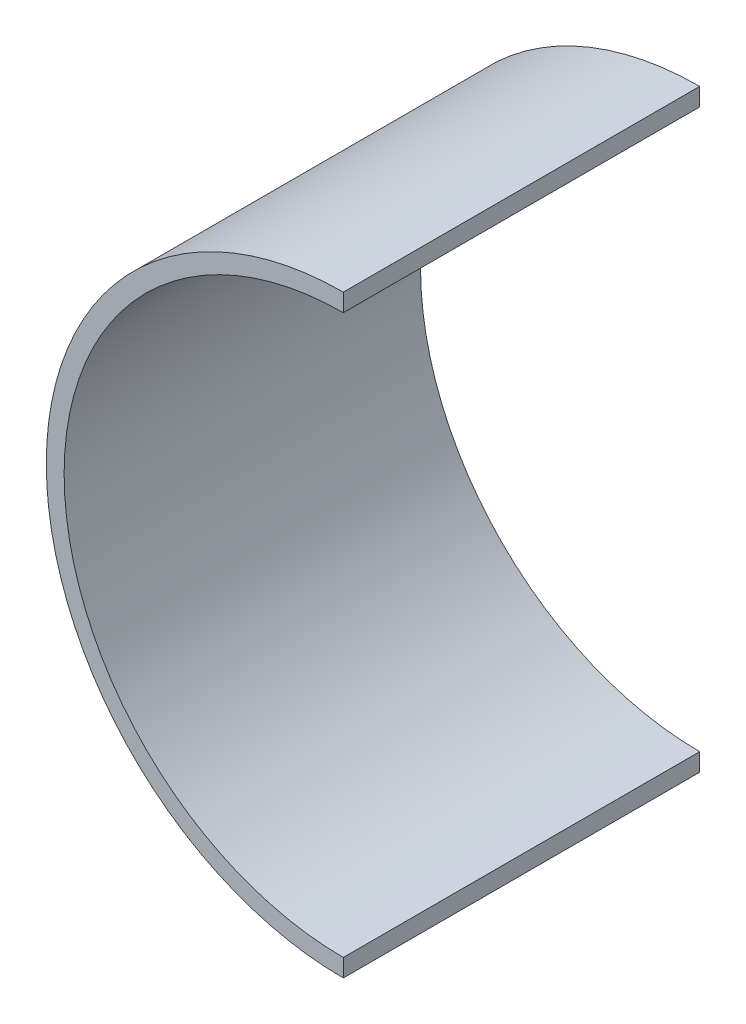
ISO-10303-21;
HEADER;
FILE_DESCRIPTION(('STEP AP214'),'2;1');
FILE_NAME('part.step','',(''),(''),'','','');
FILE_SCHEMA(('AUTOMOTIVE_DESIGN { 1 0 10303 214 1 1 1 1 }'));
ENDSEC;
DATA;
#1=APPLICATION_CONTEXT('core data for automotive mechanical design processes');
#2=APPLICATION_PROTOCOL_DEFINITION('international standard','automotive_design',2000,#1);
#3=PRODUCT_CONTEXT('',#1,'mechanical');
#4=PRODUCT('Part','Part','',(#3));
#5=PRODUCT_RELATED_PRODUCT_CATEGORY('part','',(#4));
#6=PRODUCT_DEFINITION_FORMATION('','',#4);
#7=PRODUCT_DEFINITION_CONTEXT('part definition',#1,'design');
#8=PRODUCT_DEFINITION('design','',#6,#7);
#9=PRODUCT_DEFINITION_SHAPE('','',#8);
#10=(LENGTH_UNIT() NAMED_UNIT(*) SI_UNIT(.MILLI.,.METRE.));
#11=(NAMED_UNIT(*) PLANE_ANGLE_UNIT() SI_UNIT($,.RADIAN.));
#12=(NAMED_UNIT(*) SI_UNIT($,.STERADIAN.) SOLID_ANGLE_UNIT());
#13=UNCERTAINTY_MEASURE_WITH_UNIT(LENGTH_MEASURE(1.E-05),#10,'distance_accuracy_value','');
#14=(GEOMETRIC_REPRESENTATION_CONTEXT(3) GLOBAL_UNCERTAINTY_ASSIGNED_CONTEXT((#13)) GLOBAL_UNIT_ASSIGNED_CONTEXT((#10,
#11,#12)) REPRESENTATION_CONTEXT('',''));
#15=CARTESIAN_POINT('',(0.,0.,0.));
#16=DIRECTION('',(0.,0.,1.));
#17=DIRECTION('',(1.,0.,0.));
#18=AXIS2_PLACEMENT_3D('',#15,#16,#17);
#19=CARTESIAN_POINT('',(-300.,0.,0.));
#20=DIRECTION('',(-1.,0.,0.));
#21=DIRECTION('',(0.,0.,1.));
#22=AXIS2_PLACEMENT_3D('',#19,#20,#21);
#23=PLANE('',#22);
#24=DIRECTION('',(0.,-1.,0.));
#25=VECTOR('',#24,1.);
#26=CARTESIAN_POINT('',(-300.,0.,60.));
#27=LINE('',#26,#25);
#28=CARTESIAN_POINT('',(-300.,50.,60.));
#29=VERTEX_POINT('',#28);
#30=CARTESIAN_POINT('',(-300.,47.,60.));
#31=VERTEX_POINT('',#30);
#32=EDGE_CURVE('E99',#29,#31,#27,.T.);
#33=ORIENTED_EDGE('',*,*,#32,.T.);
#34=DIRECTION('',(0.,0.,1.));
#35=VECTOR('',#34,1.);
#36=CARTESIAN_POINT('',(-300.,47.,3.));
#37=LINE('',#36,#35);
#38=CARTESIAN_POINT('',(-300.,47.,0.));
#39=VERTEX_POINT('',#38);
#40=EDGE_CURVE('E36',#39,#31,#37,.T.);
#41=ORIENTED_EDGE('',*,*,#40,.F.);
#42=DIRECTION('',(0.,-1.,0.));
#43=VECTOR('',#42,1.);
#44=CARTESIAN_POINT('',(-300.,0.,0.));
#45=LINE('',#44,#43);
#46=CARTESIAN_POINT('',(-300.,50.,0.));
#47=VERTEX_POINT('',#46);
#48=EDGE_CURVE('E82',#47,#39,#45,.T.);
#49=ORIENTED_EDGE('',*,*,#48,.F.);
#50=DIRECTION('',(0.,0.,-1.));
#51=VECTOR('',#50,1.);
#52=CARTESIAN_POINT('',(-300.,50.,60.));
#53=LINE('',#52,#51);
#54=EDGE_CURVE('E55',#29,#47,#53,.T.);
#55=ORIENTED_EDGE('',*,*,#54,.F.);
#56=EDGE_LOOP('',(#33,#41,#49,#55));
#57=FACE_BOUND('',#56,.T.);
#58=ADVANCED_FACE('F32',(#57),#23,.F.);
#59=CARTESIAN_POINT('',(-300.,-47.,60.));
#60=VERTEX_POINT('',#59);
#61=CARTESIAN_POINT('',(-300.,-50.,60.));
#62=VERTEX_POINT('',#61);
#63=EDGE_CURVE('E88',#60,#62,#27,.T.);
#64=ORIENTED_EDGE('',*,*,#63,.T.);
#65=DIRECTION('',(0.,0.,-1.));
#66=VECTOR('',#65,1.);
#67=CARTESIAN_POINT('',(-300.,-50.,60.));
#68=LINE('',#67,#66);
#69=CARTESIAN_POINT('',(-300.,-50.,0.));
#70=VERTEX_POINT('',#69);
#71=EDGE_CURVE('E85',#62,#70,#68,.T.);
#72=ORIENTED_EDGE('',*,*,#71,.T.);
#73=CARTESIAN_POINT('',(-300.,-47.,0.));
#74=VERTEX_POINT('',#73);
#75=EDGE_CURVE('E76',#74,#70,#45,.T.);
#76=ORIENTED_EDGE('',*,*,#75,.F.);
#77=DIRECTION('',(0.,0.,1.));
#78=VECTOR('',#77,1.);
#79=CARTESIAN_POINT('',(-300.,-47.,3.));
#80=LINE('',#79,#78);
#81=EDGE_CURVE('E90',#74,#60,#80,.T.);
#82=ORIENTED_EDGE('',*,*,#81,.T.);
#83=EDGE_LOOP('',(#64,#72,#76,#82));
#84=FACE_BOUND('',#83,.T.);
#85=ADVANCED_FACE('F86',(#84),#23,.F.);
#86=CARTESIAN_POINT('',(-300.,0.,3.));
#87=DIRECTION('',(0.,0.,1.));
#88=DIRECTION('',(1.,0.,0.));
#89=AXIS2_PLACEMENT_3D('',#86,#87,#88);
#90=CYLINDRICAL_SURFACE('',#89,47.);
#91=CARTESIAN_POINT('',(-300.,0.,60.));
#92=DIRECTION('',(0.,0.,1.));
#93=DIRECTION('',(1.,0.,0.));
#94=AXIS2_PLACEMENT_3D('',#91,#92,#93);
#95=CIRCLE('',#94,47.);
#96=EDGE_CURVE('E11',#31,#60,#95,.T.);
#97=ORIENTED_EDGE('',*,*,#96,.T.);
#98=ORIENTED_EDGE('',*,*,#81,.F.);
#99=CARTESIAN_POINT('',(-300.,0.,0.));
#100=DIRECTION('',(0.,0.,-1.));
#101=DIRECTION('',(-1.,0.,0.));
#102=AXIS2_PLACEMENT_3D('',#99,#100,#101);
#103=CIRCLE('',#102,47.);
#104=EDGE_CURVE('E80',#74,#39,#103,.T.);
#105=ORIENTED_EDGE('',*,*,#104,.T.);
#106=ORIENTED_EDGE('',*,*,#40,.T.);
#107=EDGE_LOOP('',(#97,#98,#105,#106));
#108=FACE_BOUND('',#107,.T.);
#109=ADVANCED_FACE('F100',(#108),#90,.F.);
#110=CARTESIAN_POINT('',(-300.,0.,60.));
#111=DIRECTION('',(0.,0.,-1.));
#112=DIRECTION('',(-1.,0.,0.));
#113=AXIS2_PLACEMENT_3D('',#110,#111,#112);
#114=CYLINDRICAL_SURFACE('',#113,50.);
#115=CARTESIAN_POINT('',(-300.,0.,0.));
#116=DIRECTION('',(0.,0.,1.));
#117=DIRECTION('',(1.,0.,0.));
#118=AXIS2_PLACEMENT_3D('',#115,#116,#117);
#119=CIRCLE('',#118,50.);
#120=EDGE_CURVE('E79',#47,#70,#119,.T.);
#121=ORIENTED_EDGE('',*,*,#120,.T.);
#122=ORIENTED_EDGE('',*,*,#71,.F.);
#123=CARTESIAN_POINT('',(-300.,0.,60.));
#124=DIRECTION('',(0.,0.,1.));
#125=DIRECTION('',(1.,0.,0.));
#126=AXIS2_PLACEMENT_3D('',#123,#124,#125);
#127=CIRCLE('',#126,50.);
#128=EDGE_CURVE('E93',#29,#62,#127,.T.);
#129=ORIENTED_EDGE('',*,*,#128,.F.);
#130=ORIENTED_EDGE('',*,*,#54,.T.);
#131=EDGE_LOOP('',(#121,#122,#129,#130));
#132=FACE_BOUND('',#131,.T.);
#133=ADVANCED_FACE('F92',(#132),#114,.T.);
#134=CARTESIAN_POINT('',(-300.,0.,60.));
#135=DIRECTION('',(0.,0.,1.));
#136=DIRECTION('',(1.,0.,0.));
#137=AXIS2_PLACEMENT_3D('',#134,#135,#136);
#138=PLANE('',#137);
#139=ORIENTED_EDGE('',*,*,#32,.F.);
#140=ORIENTED_EDGE('',*,*,#128,.T.);
#141=ORIENTED_EDGE('',*,*,#63,.F.);
#142=ORIENTED_EDGE('',*,*,#96,.F.);
#143=EDGE_LOOP('',(#139,#140,#141,#142));
#144=FACE_BOUND('',#143,.T.);
#145=ADVANCED_FACE('F34',(#144),#138,.T.);
#146=CARTESIAN_POINT('',(-300.,0.,0.));
#147=DIRECTION('',(0.,0.,1.));
#148=DIRECTION('',(1.,0.,0.));
#149=AXIS2_PLACEMENT_3D('',#146,#147,#148);
#150=PLANE('',#149);
#151=ORIENTED_EDGE('',*,*,#120,.F.);
#152=ORIENTED_EDGE('',*,*,#48,.T.);
#153=ORIENTED_EDGE('',*,*,#104,.F.);
#154=ORIENTED_EDGE('',*,*,#75,.T.);
#155=EDGE_LOOP('',(#151,#152,#153,#154));
#156=FACE_BOUND('',#155,.T.);
#157=ADVANCED_FACE('F78',(#156),#150,.F.);
#158=CLOSED_SHELL('',(#58,#85,#109,#133,#145,#157));
#159=MANIFOLD_SOLID_BREP('B2',#158);
#160=ADVANCED_BREP_SHAPE_REPRESENTATION('',(#18,#159),#14);
#161=SHAPE_DEFINITION_REPRESENTATION(#9,#160);
ENDSEC;
END-ISO-10303-21;
